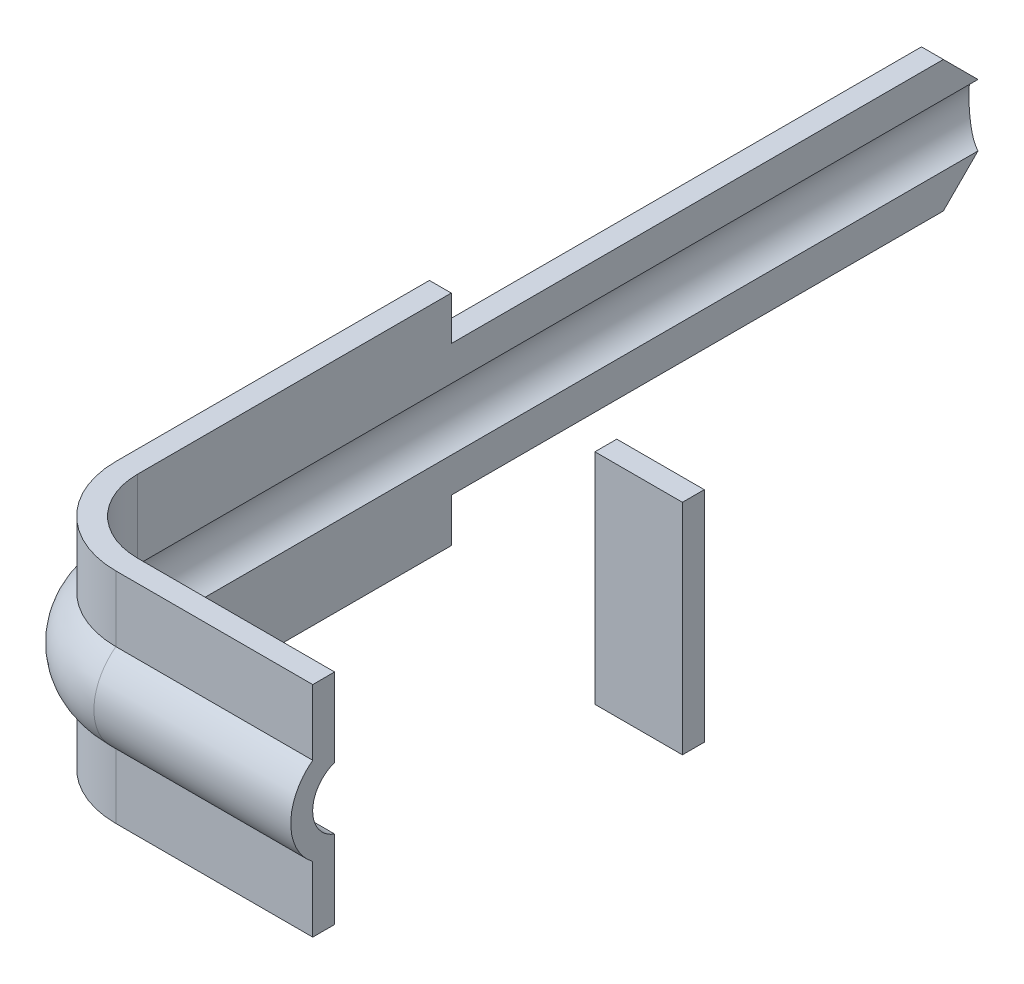
ISO-10303-21;
HEADER;
FILE_DESCRIPTION(('STEP AP214'),'2;1');
FILE_NAME('part.step','',(''),(''),'','','');
FILE_SCHEMA(('AUTOMOTIVE_DESIGN { 1 0 10303 214 1 1 1 1 }'));
ENDSEC;
DATA;
#1=APPLICATION_CONTEXT('core data for automotive mechanical design processes');
#2=APPLICATION_PROTOCOL_DEFINITION('international standard','automotive_design',2000,#1);
#3=PRODUCT_CONTEXT('',#1,'mechanical');
#4=PRODUCT('Part','Part','',(#3));
#5=PRODUCT_RELATED_PRODUCT_CATEGORY('part','',(#4));
#6=PRODUCT_DEFINITION_FORMATION('','',#4);
#7=PRODUCT_DEFINITION_CONTEXT('part definition',#1,'design');
#8=PRODUCT_DEFINITION('design','',#6,#7);
#9=PRODUCT_DEFINITION_SHAPE('','',#8);
#10=(LENGTH_UNIT() NAMED_UNIT(*) SI_UNIT(.MILLI.,.METRE.));
#11=(NAMED_UNIT(*) PLANE_ANGLE_UNIT() SI_UNIT($,.RADIAN.));
#12=(NAMED_UNIT(*) SI_UNIT($,.STERADIAN.) SOLID_ANGLE_UNIT());
#13=UNCERTAINTY_MEASURE_WITH_UNIT(LENGTH_MEASURE(1.E-05),#10,'distance_accuracy_value','');
#14=(GEOMETRIC_REPRESENTATION_CONTEXT(3) GLOBAL_UNCERTAINTY_ASSIGNED_CONTEXT((#13)) GLOBAL_UNIT_ASSIGNED_CONTEXT((#10,
#11,#12)) REPRESENTATION_CONTEXT('',''));
#15=CARTESIAN_POINT('',(0.,0.,0.));
#16=DIRECTION('',(0.,0.,1.));
#17=DIRECTION('',(1.,0.,0.));
#18=AXIS2_PLACEMENT_3D('',#15,#16,#17);
#19=CARTESIAN_POINT('',(1.585000001916,0.750000000914964,4.1242639600522));
#20=DIRECTION('',(0.,0.,-1.));
#21=DIRECTION('',(-1.,0.,0.));
#22=AXIS2_PLACEMENT_3D('',#19,#20,#21);
#23=PLANE('',#22);
#24=DIRECTION('',(0.,1.,0.));
#25=VECTOR('',#24,1.);
#26=CARTESIAN_POINT('',(2.185000001916,0.750000000914964,4.1242639600522));
#27=LINE('',#26,#25);
#28=CARTESIAN_POINT('',(2.185000001916,0.750000000914964,4.1242639600522));
#29=VERTEX_POINT('',#28);
#30=CARTESIAN_POINT('',(2.185000001916,-0.750000000186744,4.1242639600522));
#31=VERTEX_POINT('',#30);
#32=EDGE_CURVE('P0_E54',#29,#31,#27,.F.);
#33=ORIENTED_EDGE('',*,*,#32,.T.);
#34=DIRECTION('',(1.,0.,0.));
#35=VECTOR('',#34,1.);
#36=CARTESIAN_POINT('',(2.185000001916,-0.750000000186744,4.1242639600522));
#37=LINE('',#36,#35);
#38=CARTESIAN_POINT('',(1.585000001916,-0.750000000186744,4.1242639600522));
#39=VERTEX_POINT('',#38);
#40=EDGE_CURVE('P0_E75',#31,#39,#37,.F.);
#41=ORIENTED_EDGE('',*,*,#40,.T.);
#42=DIRECTION('',(0.,1.,0.));
#43=VECTOR('',#42,1.);
#44=CARTESIAN_POINT('',(1.585000001916,-0.750000000186744,4.1242639600522));
#45=LINE('',#44,#43);
#46=CARTESIAN_POINT('',(1.585000001916,0.750000000914964,4.1242639600522));
#47=VERTEX_POINT('',#46);
#48=EDGE_CURVE('P0_E57',#39,#47,#45,.T.);
#49=ORIENTED_EDGE('',*,*,#48,.T.);
#50=DIRECTION('',(1.,0.,0.));
#51=VECTOR('',#50,1.);
#52=CARTESIAN_POINT('',(1.585000001916,0.750000000914964,4.1242639600522));
#53=LINE('',#52,#51);
#54=EDGE_CURVE('P0_E19',#47,#29,#53,.T.);
#55=ORIENTED_EDGE('',*,*,#54,.T.);
#56=EDGE_LOOP('',(#33,#41,#49,#55));
#57=FACE_BOUND('',#56,.T.);
#58=ADVANCED_FACE('P0_F16',(#57),#23,.T.);
#59=CARTESIAN_POINT('',(1.585000001916,0.750000000914964,4.1242639600522));
#60=DIRECTION('',(0.,-1.,0.));
#61=DIRECTION('',(0.,0.,-1.));
#62=AXIS2_PLACEMENT_3D('',#59,#60,#61);
#63=PLANE('',#62);
#64=DIRECTION('',(0.,0.,1.));
#65=VECTOR('',#64,1.);
#66=CARTESIAN_POINT('',(2.185000001916,0.750000000914964,4.1242639600522));
#67=LINE('',#66,#65);
#68=CARTESIAN_POINT('',(2.185000001916,0.750000000914964,4.2742639600522));
#69=VERTEX_POINT('',#68);
#70=EDGE_CURVE('P0_E62',#69,#29,#67,.F.);
#71=ORIENTED_EDGE('',*,*,#70,.T.);
#72=ORIENTED_EDGE('',*,*,#54,.F.);
#73=DIRECTION('',(0.,0.,-1.));
#74=VECTOR('',#73,1.);
#75=CARTESIAN_POINT('',(1.585000001916,0.750000000914964,4.1242639600522));
#76=LINE('',#75,#74);
#77=CARTESIAN_POINT('',(1.585000001916,0.750000000914964,4.2742639600522));
#78=VERTEX_POINT('',#77);
#79=EDGE_CURVE('P0_E79',#47,#78,#76,.F.);
#80=ORIENTED_EDGE('',*,*,#79,.T.);
#81=DIRECTION('',(-1.,0.,0.));
#82=VECTOR('',#81,1.);
#83=CARTESIAN_POINT('',(1.585000001916,0.750000000914964,4.2742639600522));
#84=LINE('',#83,#82);
#85=EDGE_CURVE('P0_E72',#78,#69,#84,.F.);
#86=ORIENTED_EDGE('',*,*,#85,.T.);
#87=EDGE_LOOP('',(#71,#72,#80,#86));
#88=FACE_BOUND('',#87,.T.);
#89=ADVANCED_FACE('P0_F71',(#88),#63,.F.);
#90=CARTESIAN_POINT('',(2.185000001916,0.750000000914964,4.1242639600522));
#91=DIRECTION('',(-1.,0.,0.));
#92=DIRECTION('',(0.,0.,1.));
#93=AXIS2_PLACEMENT_3D('',#90,#91,#92);
#94=PLANE('',#93);
#95=DIRECTION('',(0.,0.,1.));
#96=VECTOR('',#95,1.);
#97=CARTESIAN_POINT('',(2.185000001916,-0.750000000186744,4.1242639600522));
#98=LINE('',#97,#96);
#99=CARTESIAN_POINT('',(2.185000001916,-0.750000000186744,4.2742639600522));
#100=VERTEX_POINT('',#99);
#101=EDGE_CURVE('P0_E68',#100,#31,#98,.F.);
#102=ORIENTED_EDGE('',*,*,#101,.T.);
#103=ORIENTED_EDGE('',*,*,#32,.F.);
#104=ORIENTED_EDGE('',*,*,#70,.F.);
#105=DIRECTION('',(0.,1.,0.));
#106=VECTOR('',#105,1.);
#107=CARTESIAN_POINT('',(2.185000001916,0.750000000914964,4.2742639600522));
#108=LINE('',#107,#106);
#109=EDGE_CURVE('P0_E82',#69,#100,#108,.F.);
#110=ORIENTED_EDGE('',*,*,#109,.T.);
#111=EDGE_LOOP('',(#102,#103,#104,#110));
#112=FACE_BOUND('',#111,.T.);
#113=ADVANCED_FACE('P0_F65',(#112),#94,.F.);
#114=CARTESIAN_POINT('',(2.185000001916,-0.750000000186744,4.1242639600522));
#115=DIRECTION('',(0.,1.,0.));
#116=DIRECTION('',(0.,0.,1.));
#117=AXIS2_PLACEMENT_3D('',#114,#115,#116);
#118=PLANE('',#117);
#119=DIRECTION('',(0.,0.,-1.));
#120=VECTOR('',#119,1.);
#121=CARTESIAN_POINT('',(1.585000001916,-0.750000000186744,4.1242639600522));
#122=LINE('',#121,#120);
#123=CARTESIAN_POINT('',(1.585000001916,-0.750000000186744,4.2742639600522));
#124=VERTEX_POINT('',#123);
#125=EDGE_CURVE('P0_E33',#124,#39,#122,.T.);
#126=ORIENTED_EDGE('',*,*,#125,.T.);
#127=ORIENTED_EDGE('',*,*,#40,.F.);
#128=ORIENTED_EDGE('',*,*,#101,.F.);
#129=DIRECTION('',(-1.,0.,0.));
#130=VECTOR('',#129,1.);
#131=CARTESIAN_POINT('',(1.585000001916,-0.750000000186744,4.2742639600522));
#132=LINE('',#131,#130);
#133=EDGE_CURVE('P0_E25',#100,#124,#132,.T.);
#134=ORIENTED_EDGE('',*,*,#133,.T.);
#135=EDGE_LOOP('',(#126,#127,#128,#134));
#136=FACE_BOUND('',#135,.T.);
#137=ADVANCED_FACE('P0_F87',(#136),#118,.F.);
#138=CARTESIAN_POINT('',(1.585000001916,-0.750000000186744,4.1242639600522));
#139=DIRECTION('',(1.,0.,0.));
#140=DIRECTION('',(0.,0.,-1.));
#141=AXIS2_PLACEMENT_3D('',#138,#139,#140);
#142=PLANE('',#141);
#143=ORIENTED_EDGE('',*,*,#79,.F.);
#144=ORIENTED_EDGE('',*,*,#48,.F.);
#145=ORIENTED_EDGE('',*,*,#125,.F.);
#146=DIRECTION('',(0.,1.,0.));
#147=VECTOR('',#146,1.);
#148=CARTESIAN_POINT('',(1.585000001916,0.750000000914964,4.2742639600522));
#149=LINE('',#148,#147);
#150=EDGE_CURVE('P0_E11',#124,#78,#149,.T.);
#151=ORIENTED_EDGE('',*,*,#150,.T.);
#152=EDGE_LOOP('',(#143,#144,#145,#151));
#153=FACE_BOUND('',#152,.T.);
#154=ADVANCED_FACE('P0_F90',(#153),#142,.F.);
#155=CARTESIAN_POINT('',(1.585000001916,0.750000000914964,4.2742639600522));
#156=DIRECTION('',(0.,0.,-1.));
#157=DIRECTION('',(-1.,0.,0.));
#158=AXIS2_PLACEMENT_3D('',#155,#156,#157);
#159=PLANE('',#158);
#160=ORIENTED_EDGE('',*,*,#133,.F.);
#161=ORIENTED_EDGE('',*,*,#109,.F.);
#162=ORIENTED_EDGE('',*,*,#85,.F.);
#163=ORIENTED_EDGE('',*,*,#150,.F.);
#164=EDGE_LOOP('',(#160,#161,#162,#163));
#165=FACE_BOUND('',#164,.T.);
#166=ADVANCED_FACE('P0_F89',(#165),#159,.F.);
#167=CLOSED_SHELL('',(#58,#89,#113,#137,#154,#166));
#168=MANIFOLD_SOLID_BREP('P0_B1',#167);
#169=CARTESIAN_POINT('',(0.224514864385138,0.,0.));
#170=DIRECTION('',(0.,0.,1.));
#171=DIRECTION('',(1.,0.,0.));
#172=AXIS2_PLACEMENT_3D('',#169,#170,#171);
#173=CYLINDRICAL_SURFACE('',#172,0.225);
#174=DIRECTION('',(0.,0.,-1.));
#175=VECTOR('',#174,1.);
#176=CARTESIAN_POINT('',(0.149999999999984,0.212302932117392,0.));
#177=LINE('',#176,#175);
#178=CARTESIAN_POINT('',(0.149999999999983,0.212302932117392,5.97426396014739));
#179=VERTEX_POINT('',#178);
#180=CARTESIAN_POINT('',(0.149757432221938,0.212217483247041,0.212217483226314));
#181=VERTEX_POINT('',#180);
#182=EDGE_CURVE('P1_E214',#179,#181,#177,.T.);
#183=ORIENTED_EDGE('',*,*,#182,.F.);
#184=CARTESIAN_POINT('',(0.224514864385138,0.,5.97426396014739));
#185=DIRECTION('',(0.,0.,1.));
#186=DIRECTION('',(-1.,0.,0.));
#187=AXIS2_PLACEMENT_3D('',#184,#185,#186);
#188=CIRCLE('',#187,0.225);
#189=CARTESIAN_POINT('',(0.15000000396699,-0.212302933509842,5.97426396014739));
#190=VERTEX_POINT('',#189);
#191=EDGE_CURVE('P1_E536',#179,#190,#188,.T.);
#192=ORIENTED_EDGE('',*,*,#191,.T.);
#193=DIRECTION('',(0.,0.,-1.));
#194=VECTOR('',#193,1.);
#195=CARTESIAN_POINT('',(0.15000000396699,-0.212302933509843,0.));
#196=LINE('',#195,#194);
#197=CARTESIAN_POINT('',(0.149757434146686,-0.212217483922541,0.212217483943265));
#198=VERTEX_POINT('',#197);
#199=EDGE_CURVE('P1_E248',#198,#190,#196,.F.);
#200=ORIENTED_EDGE('',*,*,#199,.F.);
#201=CARTESIAN_POINT('',(0.149757346702161,0.21221754393944,0.212217665156353));
#202=CARTESIAN_POINT('',(0.136913331339535,0.207665311898192,0.207641285261507));
#203=CARTESIAN_POINT('',(0.124743609192929,0.202093573160082,0.202374706611005));
#204=CARTESIAN_POINT('',(0.101764791812559,0.189038470445277,0.191163639415629));
#205=CARTESIAN_POINT('',(0.0909592756904194,0.18155022785134,0.185217442549227));
#206=CARTESIAN_POINT('',(0.0708231016284059,0.164844008717313,0.173401493911863));
#207=CARTESIAN_POINT('',(0.0614873586093797,0.155632248626892,0.167531546053112));
#208=CARTESIAN_POINT('',(0.0444262683993457,0.135522936559536,0.156374193563733));
#209=CARTESIAN_POINT('',(0.0366983669126014,0.124628107126819,0.151085871333887));
#210=CARTESIAN_POINT('',(0.0245245326978146,0.103655504290283,0.142561158713519));
#211=CARTESIAN_POINT('',(0.0197308197484496,0.0938608249430644,0.139126152403672));
#212=CARTESIAN_POINT('',(0.011551086021331,0.0734316039872059,0.133196081029953));
#213=CARTESIAN_POINT('',(0.00816396133167622,0.0627977288224827,0.130700279009129));
#214=CARTESIAN_POINT('',(0.00296983712234125,0.0408707701312072,0.126851678206735));
#215=CARTESIAN_POINT('',(0.00117302238926358,0.0295739247620855,0.125506248564731));
#216=CARTESIAN_POINT('',(-0.000674152154730775,0.00675883042992519,0.124122956573618));
#217=CARTESIAN_POINT('',(-0.000725196683673462,-0.00475932995634256,0.124084581577523));
#218=CARTESIAN_POINT('',(0.000833666883458502,-0.0264026469089063,0.125252200857111));
#219=CARTESIAN_POINT('',(0.00227132925443989,-0.0365480597377179,0.126329151778766));
#220=CARTESIAN_POINT('',(0.00646367665865537,-0.0564065368881361,0.129443181820884));
#221=CARTESIAN_POINT('',(0.00921845957677584,-0.066119569017708,0.131480332300658));
#222=CARTESIAN_POINT('',(0.0160140530283502,-0.0851947367255245,0.136441161024372));
#223=CARTESIAN_POINT('',(0.0200917183415792,-0.0945369707055503,0.139390115283347));
#224=CARTESIAN_POINT('',(0.0293447755621372,-0.112405646504791,0.145955322285442));
#225=CARTESIAN_POINT('',(0.0345208304332887,-0.120931591099158,0.149571977866256));
#226=CARTESIAN_POINT('',(0.0467655263477221,-0.138428197465193,0.157906567622749));
#227=CARTESIAN_POINT('',(0.0540056176606778,-0.147238922958504,0.16270770193375));
#228=CARTESIAN_POINT('',(0.0696222494078104,-0.163588406049553,0.172608615901019));
#229=CARTESIAN_POINT('',(0.0779992964986616,-0.171126593191963,0.177708528121245));
#230=CARTESIAN_POINT('',(0.0962391997336202,-0.185230153836376,0.18810855100274));
#231=CARTESIAN_POINT('',(0.106154613379122,-0.191730103686799,0.193406286455824));
#232=CARTESIAN_POINT('',(0.127115306318748,-0.203172042032617,0.203400371109372));
#233=CARTESIAN_POINT('',(0.138160612314672,-0.208113993697874,0.208096706091531));
#234=CARTESIAN_POINT('',(0.149757322899515,-0.212217600568487,0.212217635117401));
#235=B_SPLINE_CURVE_WITH_KNOTS('',3,(#201,#202,#203,#204,#205,#206,#207,#208,#209,#210,#211,
#212,#213,#214,#215,#216,#217,#218,#219,#220,#221,#222,#223,#224,#225,#226,#227,#228,#229,#230,
#231,#232,#233,#234),.UNSPECIFIED.,.F.,.F.,(4,2,2,2,2,2,2,2,2,2,2,2,2,2,2,2,4),(0.,
0.0429747666319987,0.0860600364104163,0.128992799998506,0.171856828737294,0.206019561810953,
0.240155432548395,0.274508369205703,0.308847831956318,0.339614768140892,0.370383991197601,
0.402097005387604,0.433829215578944,0.470813229583805,0.5078137790613,0.546619925154412,
0.585426988532671),.UNSPECIFIED.);
#236=EDGE_CURVE('P1_E174',#181,#198,#235,.T.);
#237=ORIENTED_EDGE('',*,*,#236,.F.);
#238=EDGE_LOOP('',(#183,#192,#200,#237));
#239=FACE_BOUND('',#238,.T.);
#240=ADVANCED_FACE('P1_F16',(#239),#173,.F.);
#241=CARTESIAN_POINT('',(0.65,0.,6.39974909576226));
#242=DIRECTION('',(1.,0.,0.));
#243=DIRECTION('',(0.,0.,-1.));
#244=AXIS2_PLACEMENT_3D('',#241,#242,#243);
#245=CYLINDRICAL_SURFACE('',#244,0.375);
#246=DIRECTION('',(1.,0.,0.));
#247=VECTOR('',#246,1.);
#248=CARTESIAN_POINT('',(0.65,0.300363239545214,6.62426396014739));
#249=LINE('',#248,#247);
#250=CARTESIAN_POINT('',(0.65,0.300363239545214,6.62426396014739));
#251=VERTEX_POINT('',#250);
#252=CARTESIAN_POINT('',(2.,0.300363239545216,6.62426396014739));
#253=VERTEX_POINT('',#252);
#254=EDGE_CURVE('P1_E168',#251,#253,#249,.T.);
#255=ORIENTED_EDGE('',*,*,#254,.F.);
#256=CARTESIAN_POINT('',(0.65,0.,6.39974909576226));
#257=DIRECTION('',(1.,0.,0.));
#258=DIRECTION('',(0.,0.,-1.));
#259=AXIS2_PLACEMENT_3D('',#256,#257,#258);
#260=CIRCLE('',#259,0.375);
#261=CARTESIAN_POINT('',(0.65,-0.300363239545311,6.62426396014739));
#262=VERTEX_POINT('',#261);
#263=EDGE_CURVE('P1_E173',#251,#262,#260,.T.);
#264=ORIENTED_EDGE('',*,*,#263,.T.);
#265=DIRECTION('',(1.,0.,0.));
#266=VECTOR('',#265,1.);
#267=CARTESIAN_POINT('',(0.65,-0.30036323954531,6.62426396014739));
#268=LINE('',#267,#266);
#269=CARTESIAN_POINT('',(2.,-0.300363239545312,6.62426396014739));
#270=VERTEX_POINT('',#269);
#271=EDGE_CURVE('P1_E171',#270,#262,#268,.F.);
#272=ORIENTED_EDGE('',*,*,#271,.F.);
#273=CARTESIAN_POINT('',(2.,0.,6.39974909576226));
#274=DIRECTION('',(1.,0.,0.));
#275=DIRECTION('',(0.,0.,-1.));
#276=AXIS2_PLACEMENT_3D('',#273,#274,#275);
#277=CIRCLE('',#276,0.375);
#278=EDGE_CURVE('P1_E162',#270,#253,#277,.F.);
#279=ORIENTED_EDGE('',*,*,#278,.T.);
#280=EDGE_LOOP('',(#255,#264,#272,#279));
#281=FACE_BOUND('',#280,.T.);
#282=ADVANCED_FACE('P1_F167',(#281),#245,.T.);
#283=CARTESIAN_POINT('',(0.65,0.,6.39974909576226));
#284=DIRECTION('',(1.,0.,0.));
#285=DIRECTION('',(0.,0.,-1.));
#286=AXIS2_PLACEMENT_3D('',#283,#284,#285);
#287=CYLINDRICAL_SURFACE('',#286,0.225);
#288=CARTESIAN_POINT('',(2.,0.,6.39974909576226));
#289=DIRECTION('',(1.,0.,0.));
#290=DIRECTION('',(0.,0.,-1.));
#291=AXIS2_PLACEMENT_3D('',#288,#289,#290);
#292=CIRCLE('',#291,0.225);
#293=CARTESIAN_POINT('',(2.,0.212302932117393,6.47426396014741));
#294=VERTEX_POINT('',#293);
#295=CARTESIAN_POINT('',(2.,-0.212302933509843,6.4742639561804));
#296=VERTEX_POINT('',#295);
#297=EDGE_CURVE('P1_E189',#294,#296,#292,.T.);
#298=ORIENTED_EDGE('',*,*,#297,.T.);
#299=DIRECTION('',(-1.,0.,0.));
#300=VECTOR('',#299,1.);
#301=CARTESIAN_POINT('',(0.65,-0.212302933509842,6.4742639561804));
#302=LINE('',#301,#300);
#303=CARTESIAN_POINT('',(0.65,-0.212302933509842,6.4742639561804));
#304=VERTEX_POINT('',#303);
#305=EDGE_CURVE('P1_E231',#304,#296,#302,.F.);
#306=ORIENTED_EDGE('',*,*,#305,.F.);
#307=CARTESIAN_POINT('',(0.65,0.,6.39974909576225));
#308=DIRECTION('',(1.,0.,0.));
#309=DIRECTION('',(0.,0.,1.));
#310=AXIS2_PLACEMENT_3D('',#307,#308,#309);
#311=CIRCLE('',#310,0.225);
#312=CARTESIAN_POINT('',(0.65,0.212302932117392,6.47426396014741));
#313=VERTEX_POINT('',#312);
#314=EDGE_CURVE('P1_E249',#304,#313,#311,.F.);
#315=ORIENTED_EDGE('',*,*,#314,.T.);
#316=DIRECTION('',(-1.,0.,0.));
#317=VECTOR('',#316,1.);
#318=CARTESIAN_POINT('',(0.65,0.212302932117392,6.47426396014741));
#319=LINE('',#318,#317);
#320=EDGE_CURVE('P1_E252',#294,#313,#319,.T.);
#321=ORIENTED_EDGE('',*,*,#320,.F.);
#322=EDGE_LOOP('',(#298,#306,#315,#321));
#323=FACE_BOUND('',#322,.T.);
#324=ADVANCED_FACE('P1_F273',(#323),#287,.F.);
#325=CARTESIAN_POINT('',(0.65,0.,5.97426396014739));
#326=DIRECTION('',(0.,1.,0.));
#327=DIRECTION('',(0.,0.,1.));
#328=AXIS2_PLACEMENT_3D('',#325,#326,#327);
#329=TOROIDAL_SURFACE('',#328,0.425485135614863,0.225);
#330=ORIENTED_EDGE('',*,*,#314,.F.);
#331=CARTESIAN_POINT('',(0.65,-0.212302933509842,5.97426396014739));
#332=DIRECTION('',(0.,1.,0.));
#333=DIRECTION('',(0.,0.,1.));
#334=AXIS2_PLACEMENT_3D('',#331,#332,#333);
#335=CIRCLE('',#334,0.49999999603301);
#336=EDGE_CURVE('P1_E236',#304,#190,#335,.F.);
#337=ORIENTED_EDGE('',*,*,#336,.T.);
#338=ORIENTED_EDGE('',*,*,#191,.F.);
#339=CARTESIAN_POINT('',(0.65,0.212302932117392,5.97426396014739));
#340=DIRECTION('',(0.,1.,0.));
#341=DIRECTION('',(0.,0.,1.));
#342=AXIS2_PLACEMENT_3D('',#339,#340,#341);
#343=CIRCLE('',#342,0.500000000000017);
#344=EDGE_CURVE('P1_E258',#179,#313,#343,.T.);
#345=ORIENTED_EDGE('',*,*,#344,.T.);
#346=EDGE_LOOP('',(#330,#337,#338,#345));
#347=FACE_BOUND('',#346,.T.);
#348=ADVANCED_FACE('P1_F268',(#347),#329,.F.);
#349=CARTESIAN_POINT('',(0.15000000396699,-0.75,0.));
#350=DIRECTION('',(1.,0.,0.));
#351=DIRECTION('',(0.,0.,-1.));
#352=AXIS2_PLACEMENT_3D('',#349,#350,#351);
#353=PLANE('',#352);
#354=DIRECTION('',(0.,0.,-1.));
#355=VECTOR('',#354,1.);
#356=CARTESIAN_POINT('',(0.150000003738779,-0.75,0.));
#357=LINE('',#356,#355);
#358=CARTESIAN_POINT('',(0.150000003738779,-0.75,3.82426435382759));
#359=VERTEX_POINT('',#358);
#360=CARTESIAN_POINT('',(0.150000003852885,-0.75,5.97426396014739));
#361=VERTEX_POINT('',#360);
#362=EDGE_CURVE('P1_E393',#359,#361,#357,.F.);
#363=ORIENTED_EDGE('',*,*,#362,.F.);
#364=DIRECTION('',(0.,1.,0.));
#365=VECTOR('',#364,1.);
#366=CARTESIAN_POINT('',(0.150000003738779,-0.449999999979276,3.82426435382759));
#367=LINE('',#366,#365);
#368=CARTESIAN_POINT('',(0.150000003776814,-0.449999999979276,3.82426435382759));
#369=VERTEX_POINT('',#368);
#370=EDGE_CURVE('P1_E239',#369,#359,#367,.F.);
#371=ORIENTED_EDGE('',*,*,#370,.F.);
#372=DIRECTION('',(0.,0.,-1.));
#373=VECTOR('',#372,1.);
#374=CARTESIAN_POINT('',(0.150000003852885,-0.449999999979276,0.));
#375=LINE('',#374,#373);
#376=CARTESIAN_POINT('',(0.15000000389092,-0.449999999979276,0.45));
#377=VERTEX_POINT('',#376);
#378=EDGE_CURVE('P1_E419',#377,#369,#375,.F.);
#379=ORIENTED_EDGE('',*,*,#378,.F.);
#380=DIRECTION('',(0.,0.707106781186547,-0.707106781186548));
#381=VECTOR('',#380,1.);
#382=CARTESIAN_POINT('',(0.15000000396699,-0.449999999979276,0.45));
#383=LINE('',#382,#381);
#384=EDGE_CURVE('P1_E245',#377,#198,#383,.T.);
#385=ORIENTED_EDGE('',*,*,#384,.T.);
#386=ORIENTED_EDGE('',*,*,#199,.T.);
#387=DIRECTION('',(0.,1.,0.));
#388=VECTOR('',#387,1.);
#389=CARTESIAN_POINT('',(0.15000000396699,0.,5.97426396014739));
#390=LINE('',#389,#388);
#391=EDGE_CURVE('P1_E232',#190,#361,#390,.F.);
#392=ORIENTED_EDGE('',*,*,#391,.T.);
#393=EDGE_LOOP('',(#363,#371,#379,#385,#386,#392));
#394=FACE_BOUND('',#393,.T.);
#395=ADVANCED_FACE('P1_F272',(#394),#353,.T.);
#396=CARTESIAN_POINT('',(0.65,0.,5.97426396014739));
#397=DIRECTION('',(0.,1.,0.));
#398=DIRECTION('',(0.,0.,1.));
#399=AXIS2_PLACEMENT_3D('',#396,#397,#398);
#400=CYLINDRICAL_SURFACE('',#399,0.49999999603301);
#401=CARTESIAN_POINT('',(0.65,-0.75,5.97426396014739));
#402=DIRECTION('',(0.,1.,0.));
#403=DIRECTION('',(0.,0.,1.));
#404=AXIS2_PLACEMENT_3D('',#401,#402,#403);
#405=CIRCLE('',#404,0.49999999603301);
#406=CARTESIAN_POINT('',(0.65,-0.75,6.4742639561804));
#407=VERTEX_POINT('',#406);
#408=EDGE_CURVE('P1_E388',#361,#407,#405,.T.);
#409=ORIENTED_EDGE('',*,*,#408,.F.);
#410=ORIENTED_EDGE('',*,*,#391,.F.);
#411=ORIENTED_EDGE('',*,*,#336,.F.);
#412=DIRECTION('',(0.,1.,0.));
#413=VECTOR('',#412,1.);
#414=CARTESIAN_POINT('',(0.65,-0.75,6.4742639561804));
#415=LINE('',#414,#413);
#416=EDGE_CURVE('P1_E228',#407,#304,#415,.T.);
#417=ORIENTED_EDGE('',*,*,#416,.F.);
#418=EDGE_LOOP('',(#409,#410,#411,#417));
#419=FACE_BOUND('',#418,.T.);
#420=ADVANCED_FACE('P1_F377',(#419),#400,.F.);
#421=CARTESIAN_POINT('',(0.65,-0.75,6.4742639561804));
#422=DIRECTION('',(0.,0.,-1.));
#423=DIRECTION('',(-1.,0.,0.));
#424=AXIS2_PLACEMENT_3D('',#421,#422,#423);
#425=PLANE('',#424);
#426=ORIENTED_EDGE('',*,*,#416,.T.);
#427=ORIENTED_EDGE('',*,*,#305,.T.);
#428=DIRECTION('',(0.,1.,0.));
#429=VECTOR('',#428,1.);
#430=CARTESIAN_POINT('',(2.,0.,6.4742639561804));
#431=LINE('',#430,#429);
#432=CARTESIAN_POINT('',(2.,-0.75,6.4742639561804));
#433=VERTEX_POINT('',#432);
#434=EDGE_CURVE('P1_E182',#296,#433,#431,.F.);
#435=ORIENTED_EDGE('',*,*,#434,.T.);
#436=DIRECTION('',(1.,0.,0.));
#437=VECTOR('',#436,1.);
#438=CARTESIAN_POINT('',(0.,-0.75,6.4742639561804));
#439=LINE('',#438,#437);
#440=EDGE_CURVE('P1_E225',#407,#433,#439,.T.);
#441=ORIENTED_EDGE('',*,*,#440,.F.);
#442=EDGE_LOOP('',(#426,#427,#435,#441));
#443=FACE_BOUND('',#442,.T.);
#444=ADVANCED_FACE('P1_F374',(#443),#425,.T.);
#445=CARTESIAN_POINT('',(0.65,-0.30036323954531,6.62426396014739));
#446=DIRECTION('',(0.,0.,1.));
#447=DIRECTION('',(1.,0.,0.));
#448=AXIS2_PLACEMENT_3D('',#445,#446,#447);
#449=PLANE('',#448);
#450=ORIENTED_EDGE('',*,*,#271,.T.);
#451=DIRECTION('',(0.,1.,0.));
#452=VECTOR('',#451,1.);
#453=CARTESIAN_POINT('',(0.65,-0.30036323954531,6.62426396014739));
#454=LINE('',#453,#452);
#455=CARTESIAN_POINT('',(0.65,-0.75,6.62426396014739));
#456=VERTEX_POINT('',#455);
#457=EDGE_CURVE('P1_E217',#262,#456,#454,.F.);
#458=ORIENTED_EDGE('',*,*,#457,.T.);
#459=DIRECTION('',(1.,0.,0.));
#460=VECTOR('',#459,1.);
#461=CARTESIAN_POINT('',(0.,-0.75,6.62426396014739));
#462=LINE('',#461,#460);
#463=CARTESIAN_POINT('',(2.,-0.75,6.62426396014739));
#464=VERTEX_POINT('',#463);
#465=EDGE_CURVE('P1_E224',#464,#456,#462,.F.);
#466=ORIENTED_EDGE('',*,*,#465,.F.);
#467=DIRECTION('',(0.,1.,0.));
#468=VECTOR('',#467,1.);
#469=CARTESIAN_POINT('',(2.,0.,6.62426396014739));
#470=LINE('',#469,#468);
#471=EDGE_CURVE('P1_E190',#464,#270,#470,.T.);
#472=ORIENTED_EDGE('',*,*,#471,.T.);
#473=EDGE_LOOP('',(#450,#458,#466,#472));
#474=FACE_BOUND('',#473,.T.);
#475=ADVANCED_FACE('P1_F370',(#474),#449,.T.);
#476=CARTESIAN_POINT('',(0.149999999999984,0.212302932117392,0.));
#477=DIRECTION('',(1.,0.,0.));
#478=DIRECTION('',(0.,0.,-1.));
#479=AXIS2_PLACEMENT_3D('',#476,#477,#478);
#480=PLANE('',#479);
#481=DIRECTION('',(0.,0.,1.));
#482=VECTOR('',#481,1.);
#483=CARTESIAN_POINT('',(0.149999999999983,0.75,0.));
#484=LINE('',#483,#482);
#485=CARTESIAN_POINT('',(0.149999999999983,0.75,5.97426396014739));
#486=VERTEX_POINT('',#485);
#487=CARTESIAN_POINT('',(0.149999999923994,0.75,3.82426435382759));
#488=VERTEX_POINT('',#487);
#489=EDGE_CURVE('P1_E461',#486,#488,#484,.F.);
#490=ORIENTED_EDGE('',*,*,#489,.F.);
#491=DIRECTION('',(0.,1.,0.));
#492=VECTOR('',#491,1.);
#493=CARTESIAN_POINT('',(0.149999999999983,0.,5.97426396014739));
#494=LINE('',#493,#492);
#495=EDGE_CURVE('P1_E255',#486,#179,#494,.F.);
#496=ORIENTED_EDGE('',*,*,#495,.T.);
#497=ORIENTED_EDGE('',*,*,#182,.T.);
#498=DIRECTION('',(0.,0.707106781186546,0.707106781186549));
#499=VECTOR('',#498,1.);
#500=CARTESIAN_POINT('',(0.149999999999984,0.212302932117392,0.212302932096665));
#501=LINE('',#500,#499);
#502=CARTESIAN_POINT('',(0.149999999923994,0.450000000020726,0.45));
#503=VERTEX_POINT('',#502);
#504=EDGE_CURVE('P1_E208',#181,#503,#501,.T.);
#505=ORIENTED_EDGE('',*,*,#504,.T.);
#506=DIRECTION('',(0.,0.,1.));
#507=VECTOR('',#506,1.);
#508=CARTESIAN_POINT('',(0.149999999772015,0.450000000020726,3.82426435382759));
#509=LINE('',#508,#507);
#510=CARTESIAN_POINT('',(0.149999999848004,0.450000000020726,3.82426435382759));
#511=VERTEX_POINT('',#510);
#512=EDGE_CURVE('P1_E437',#511,#503,#509,.F.);
#513=ORIENTED_EDGE('',*,*,#512,.F.);
#514=DIRECTION('',(0.,1.,0.));
#515=VECTOR('',#514,1.);
#516=CARTESIAN_POINT('',(0.149999999999983,0.212302932117392,3.82426435382759));
#517=LINE('',#516,#515);
#518=EDGE_CURVE('P1_E183',#511,#488,#517,.T.);
#519=ORIENTED_EDGE('',*,*,#518,.T.);
#520=EDGE_LOOP('',(#490,#496,#497,#505,#513,#519));
#521=FACE_BOUND('',#520,.T.);
#522=ADVANCED_FACE('P1_F367',(#521),#480,.T.);
#523=CARTESIAN_POINT('',(0.65,0.75,6.62426396014739));
#524=DIRECTION('',(0.,0.,1.));
#525=DIRECTION('',(1.,0.,0.));
#526=AXIS2_PLACEMENT_3D('',#523,#524,#525);
#527=PLANE('',#526);
#528=DIRECTION('',(1.,0.,0.));
#529=VECTOR('',#528,1.);
#530=CARTESIAN_POINT('',(0.149999999999984,0.75,6.62426396014739));
#531=LINE('',#530,#529);
#532=CARTESIAN_POINT('',(0.65,0.75,6.62426396014739));
#533=VERTEX_POINT('',#532);
#534=CARTESIAN_POINT('',(2.,0.75,6.62426396014739));
#535=VERTEX_POINT('',#534);
#536=EDGE_CURVE('P1_E454',#533,#535,#531,.T.);
#537=ORIENTED_EDGE('',*,*,#536,.F.);
#538=DIRECTION('',(0.,1.,0.));
#539=VECTOR('',#538,1.);
#540=CARTESIAN_POINT('',(0.65,0.,6.62426396014739));
#541=LINE('',#540,#539);
#542=EDGE_CURVE('P1_E181',#251,#533,#541,.T.);
#543=ORIENTED_EDGE('',*,*,#542,.F.);
#544=ORIENTED_EDGE('',*,*,#254,.T.);
#545=DIRECTION('',(0.,1.,0.));
#546=VECTOR('',#545,1.);
#547=CARTESIAN_POINT('',(2.,0.,6.62426396014739));
#548=LINE('',#547,#546);
#549=EDGE_CURVE('P1_E179',#253,#535,#548,.T.);
#550=ORIENTED_EDGE('',*,*,#549,.T.);
#551=EDGE_LOOP('',(#537,#543,#544,#550));
#552=FACE_BOUND('',#551,.T.);
#553=ADVANCED_FACE('P1_F178',(#552),#527,.T.);
#554=CARTESIAN_POINT('',(2.,0.,6.39974909576226));
#555=DIRECTION('',(-1.,0.,0.));
#556=DIRECTION('',(0.,0.,1.));
#557=AXIS2_PLACEMENT_3D('',#554,#555,#556);
#558=PLANE('',#557);
#559=DIRECTION('',(0.,1.,0.));
#560=VECTOR('',#559,1.);
#561=CARTESIAN_POINT('',(2.,0.212302932117392,6.47426396014741));
#562=LINE('',#561,#560);
#563=CARTESIAN_POINT('',(2.,0.75,6.47426396014741));
#564=VERTEX_POINT('',#563);
#565=EDGE_CURVE('P1_E193',#564,#294,#562,.F.);
#566=ORIENTED_EDGE('',*,*,#565,.F.);
#567=DIRECTION('',(0.,0.,1.));
#568=VECTOR('',#567,1.);
#569=CARTESIAN_POINT('',(2.,0.75,0.));
#570=LINE('',#569,#568);
#571=EDGE_CURVE('P1_E187',#535,#564,#570,.F.);
#572=ORIENTED_EDGE('',*,*,#571,.F.);
#573=ORIENTED_EDGE('',*,*,#549,.F.);
#574=ORIENTED_EDGE('',*,*,#278,.F.);
#575=ORIENTED_EDGE('',*,*,#471,.F.);
#576=DIRECTION('',(0.,0.,-1.));
#577=VECTOR('',#576,1.);
#578=CARTESIAN_POINT('',(2.,-0.75,0.));
#579=LINE('',#578,#577);
#580=EDGE_CURVE('P1_E221',#433,#464,#579,.F.);
#581=ORIENTED_EDGE('',*,*,#580,.F.);
#582=ORIENTED_EDGE('',*,*,#434,.F.);
#583=ORIENTED_EDGE('',*,*,#297,.F.);
#584=EDGE_LOOP('',(#566,#572,#573,#574,#575,#581,#582,#583));
#585=FACE_BOUND('',#584,.T.);
#586=ADVANCED_FACE('P1_F185',(#585),#558,.F.);
#587=CARTESIAN_POINT('',(0.65,0.212302932117392,6.47426396014741));
#588=DIRECTION('',(0.,0.,-1.));
#589=DIRECTION('',(-1.,0.,0.));
#590=AXIS2_PLACEMENT_3D('',#587,#588,#589);
#591=PLANE('',#590);
#592=ORIENTED_EDGE('',*,*,#320,.T.);
#593=DIRECTION('',(0.,1.,0.));
#594=VECTOR('',#593,1.);
#595=CARTESIAN_POINT('',(0.65,0.,6.47426396014741));
#596=LINE('',#595,#594);
#597=CARTESIAN_POINT('',(0.65,0.75,6.47426396014741));
#598=VERTEX_POINT('',#597);
#599=EDGE_CURVE('P1_E261',#313,#598,#596,.T.);
#600=ORIENTED_EDGE('',*,*,#599,.T.);
#601=DIRECTION('',(1.,0.,0.));
#602=VECTOR('',#601,1.);
#603=CARTESIAN_POINT('',(0.149999999999984,0.75,6.47426396014741));
#604=LINE('',#603,#602);
#605=EDGE_CURVE('P1_E453',#564,#598,#604,.F.);
#606=ORIENTED_EDGE('',*,*,#605,.F.);
#607=ORIENTED_EDGE('',*,*,#565,.T.);
#608=EDGE_LOOP('',(#592,#600,#606,#607));
#609=FACE_BOUND('',#608,.T.);
#610=ADVANCED_FACE('P1_F358',(#609),#591,.T.);
#611=CARTESIAN_POINT('',(0.65,0.,5.97426396014739));
#612=DIRECTION('',(0.,1.,0.));
#613=DIRECTION('',(0.,0.,1.));
#614=AXIS2_PLACEMENT_3D('',#611,#612,#613);
#615=CYLINDRICAL_SURFACE('',#614,0.500000000000017);
#616=ORIENTED_EDGE('',*,*,#599,.F.);
#617=ORIENTED_EDGE('',*,*,#344,.F.);
#618=ORIENTED_EDGE('',*,*,#495,.F.);
#619=CARTESIAN_POINT('',(0.65,0.75,5.97426396014739));
#620=DIRECTION('',(0.,1.,0.));
#621=DIRECTION('',(0.,0.,1.));
#622=AXIS2_PLACEMENT_3D('',#619,#620,#621);
#623=CIRCLE('',#622,0.500000000000017);
#624=EDGE_CURVE('P1_E456',#598,#486,#623,.F.);
#625=ORIENTED_EDGE('',*,*,#624,.F.);
#626=EDGE_LOOP('',(#616,#617,#618,#625));
#627=FACE_BOUND('',#626,.T.);
#628=ADVANCED_FACE('P1_F354',(#627),#615,.F.);
#629=CARTESIAN_POINT('',(0.150000003738779,-0.449999999979276,0.));
#630=DIRECTION('',(0.,-1.,0.));
#631=DIRECTION('',(0.,0.,-1.));
#632=AXIS2_PLACEMENT_3D('',#629,#630,#631);
#633=PLANE('',#632);
#634=ORIENTED_EDGE('',*,*,#378,.T.);
#635=DIRECTION('',(-1.,0.,0.));
#636=VECTOR('',#635,1.);
#637=CARTESIAN_POINT('',(0.150000003738779,-0.449999999979276,3.82426435382759));
#638=LINE('',#637,#636);
#639=CARTESIAN_POINT('',(0.,-0.449999999979276,3.82426435382759));
#640=VERTEX_POINT('',#639);
#641=EDGE_CURVE('P1_E242',#640,#369,#638,.F.);
#642=ORIENTED_EDGE('',*,*,#641,.F.);
#643=DIRECTION('',(0.,0.,1.));
#644=VECTOR('',#643,1.);
#645=CARTESIAN_POINT('',(0.,-0.449999999979276,0.));
#646=LINE('',#645,#644);
#647=CARTESIAN_POINT('',(0.,-0.449999999979276,0.45));
#648=VERTEX_POINT('',#647);
#649=EDGE_CURVE('P1_E414',#648,#640,#646,.T.);
#650=ORIENTED_EDGE('',*,*,#649,.F.);
#651=DIRECTION('',(1.,0.,0.));
#652=VECTOR('',#651,1.);
#653=CARTESIAN_POINT('',(0.224514864385138,-0.449999999979276,0.45));
#654=LINE('',#653,#652);
#655=EDGE_CURVE('P1_E427',#648,#377,#654,.T.);
#656=ORIENTED_EDGE('',*,*,#655,.T.);
#657=EDGE_LOOP('',(#634,#642,#650,#656));
#658=FACE_BOUND('',#657,.T.);
#659=ADVANCED_FACE('P1_F350',(#658),#633,.T.);
#660=CARTESIAN_POINT('',(0.150000003738779,-0.449999999979276,3.82426435382759));
#661=DIRECTION('',(0.,0.,-1.));
#662=DIRECTION('',(-1.,0.,0.));
#663=AXIS2_PLACEMENT_3D('',#660,#661,#662);
#664=PLANE('',#663);
#665=ORIENTED_EDGE('',*,*,#370,.T.);
#666=DIRECTION('',(1.,0.,0.));
#667=VECTOR('',#666,1.);
#668=CARTESIAN_POINT('',(0.,-0.75,3.82426435382759));
#669=LINE('',#668,#667);
#670=CARTESIAN_POINT('',(0.,-0.75,3.82426435382759));
#671=VERTEX_POINT('',#670);
#672=EDGE_CURVE('P1_E241',#671,#359,#669,.T.);
#673=ORIENTED_EDGE('',*,*,#672,.F.);
#674=DIRECTION('',(0.,1.,0.));
#675=VECTOR('',#674,1.);
#676=CARTESIAN_POINT('',(0.,-0.300363239545311,3.82426435382759));
#677=LINE('',#676,#675);
#678=EDGE_CURVE('P1_E410',#640,#671,#677,.F.);
#679=ORIENTED_EDGE('',*,*,#678,.F.);
#680=ORIENTED_EDGE('',*,*,#641,.T.);
#681=EDGE_LOOP('',(#665,#673,#679,#680));
#682=FACE_BOUND('',#681,.T.);
#683=ADVANCED_FACE('P1_F346',(#682),#664,.T.);
#684=CARTESIAN_POINT('',(0.,-0.75,0.));
#685=DIRECTION('',(0.,-1.,0.));
#686=DIRECTION('',(0.,0.,-1.));
#687=AXIS2_PLACEMENT_3D('',#684,#685,#686);
#688=PLANE('',#687);
#689=ORIENTED_EDGE('',*,*,#465,.T.);
#690=CARTESIAN_POINT('',(0.65,-0.75,5.97426396014739));
#691=DIRECTION('',(0.,1.,0.));
#692=DIRECTION('',(0.,0.,1.));
#693=AXIS2_PLACEMENT_3D('',#690,#691,#692);
#694=CIRCLE('',#693,0.65);
#695=CARTESIAN_POINT('',(0.,-0.75,5.97426396014739));
#696=VERTEX_POINT('',#695);
#697=EDGE_CURVE('P1_E440',#696,#456,#694,.T.);
#698=ORIENTED_EDGE('',*,*,#697,.F.);
#699=DIRECTION('',(0.,0.,1.));
#700=VECTOR('',#699,1.);
#701=CARTESIAN_POINT('',(0.,-0.75,0.));
#702=LINE('',#701,#700);
#703=EDGE_CURVE('P1_E413',#671,#696,#702,.T.);
#704=ORIENTED_EDGE('',*,*,#703,.F.);
#705=ORIENTED_EDGE('',*,*,#672,.T.);
#706=ORIENTED_EDGE('',*,*,#362,.T.);
#707=ORIENTED_EDGE('',*,*,#408,.T.);
#708=ORIENTED_EDGE('',*,*,#440,.T.);
#709=ORIENTED_EDGE('',*,*,#580,.T.);
#710=EDGE_LOOP('',(#689,#698,#704,#705,#706,#707,#708,#709));
#711=FACE_BOUND('',#710,.T.);
#712=ADVANCED_FACE('P1_F342',(#711),#688,.T.);
#713=CARTESIAN_POINT('',(0.65,0.,5.97426396014739));
#714=DIRECTION('',(0.,1.,0.));
#715=DIRECTION('',(0.,0.,1.));
#716=AXIS2_PLACEMENT_3D('',#713,#714,#715);
#717=CYLINDRICAL_SURFACE('',#716,0.65);
#718=CARTESIAN_POINT('',(0.65,-0.30036323954531,5.97426396014739));
#719=DIRECTION('',(0.,1.,0.));
#720=DIRECTION('',(0.,0.,1.));
#721=AXIS2_PLACEMENT_3D('',#718,#719,#720);
#722=CIRCLE('',#721,0.649999999999998);
#723=CARTESIAN_POINT('',(0.,-0.30036323954531,5.97426396014739));
#724=VERTEX_POINT('',#723);
#725=EDGE_CURVE('P1_E742',#724,#262,#722,.T.);
#726=ORIENTED_EDGE('',*,*,#725,.F.);
#727=DIRECTION('',(0.,1.,0.));
#728=VECTOR('',#727,1.);
#729=CARTESIAN_POINT('',(0.,-0.300363239545311,5.97426396014739));
#730=LINE('',#729,#728);
#731=EDGE_CURVE('P1_E508',#696,#724,#730,.T.);
#732=ORIENTED_EDGE('',*,*,#731,.F.);
#733=ORIENTED_EDGE('',*,*,#697,.T.);
#734=ORIENTED_EDGE('',*,*,#457,.F.);
#735=EDGE_LOOP('',(#726,#732,#733,#734));
#736=FACE_BOUND('',#735,.T.);
#737=ADVANCED_FACE('P1_F338',(#736),#717,.T.);
#738=CARTESIAN_POINT('',(0.149999999772015,0.450000000020726,3.82426435382759));
#739=DIRECTION('',(0.,1.,0.));
#740=DIRECTION('',(0.,0.,1.));
#741=AXIS2_PLACEMENT_3D('',#738,#739,#740);
#742=PLANE('',#741);
#743=DIRECTION('',(0.,0.,1.));
#744=VECTOR('',#743,1.);
#745=CARTESIAN_POINT('',(0.,0.450000000020726,0.));
#746=LINE('',#745,#744);
#747=CARTESIAN_POINT('',(0.,0.450000000020726,3.82426435382759));
#748=VERTEX_POINT('',#747);
#749=CARTESIAN_POINT('',(0.,0.450000000020726,0.45));
#750=VERTEX_POINT('',#749);
#751=EDGE_CURVE('P1_E492',#748,#750,#746,.F.);
#752=ORIENTED_EDGE('',*,*,#751,.F.);
#753=DIRECTION('',(-1.,0.,0.));
#754=VECTOR('',#753,1.);
#755=CARTESIAN_POINT('',(0.149999999772015,0.450000000020726,3.82426435382759));
#756=LINE('',#755,#754);
#757=EDGE_CURVE('P1_E486',#511,#748,#756,.T.);
#758=ORIENTED_EDGE('',*,*,#757,.F.);
#759=ORIENTED_EDGE('',*,*,#512,.T.);
#760=DIRECTION('',(1.,0.,0.));
#761=VECTOR('',#760,1.);
#762=CARTESIAN_POINT('',(0.149999999772015,0.450000000020726,0.45));
#763=LINE('',#762,#761);
#764=EDGE_CURVE('P1_E485',#503,#750,#763,.F.);
#765=ORIENTED_EDGE('',*,*,#764,.T.);
#766=EDGE_LOOP('',(#752,#758,#759,#765));
#767=FACE_BOUND('',#766,.T.);
#768=ADVANCED_FACE('P1_F335',(#767),#742,.T.);
#769=CARTESIAN_POINT('',(0.65,0.,5.97426396014739));
#770=DIRECTION('',(0.,1.,0.));
#771=DIRECTION('',(0.,0.,1.));
#772=AXIS2_PLACEMENT_3D('',#769,#770,#771);
#773=CYLINDRICAL_SURFACE('',#772,0.65);
#774=CARTESIAN_POINT('',(0.65,0.75,5.97426396014739));
#775=DIRECTION('',(0.,1.,0.));
#776=DIRECTION('',(0.,0.,1.));
#777=AXIS2_PLACEMENT_3D('',#774,#775,#776);
#778=CIRCLE('',#777,0.65);
#779=CARTESIAN_POINT('',(0.,0.75,5.97426396014739));
#780=VERTEX_POINT('',#779);
#781=EDGE_CURVE('P1_E458',#780,#533,#778,.T.);
#782=ORIENTED_EDGE('',*,*,#781,.F.);
#783=DIRECTION('',(0.,-1.,0.));
#784=VECTOR('',#783,1.);
#785=CARTESIAN_POINT('',(0.,0.75,5.97426396014739));
#786=LINE('',#785,#784);
#787=CARTESIAN_POINT('',(0.,0.300363239545213,5.97426396014739));
#788=VERTEX_POINT('',#787);
#789=EDGE_CURVE('P1_E40',#788,#780,#786,.F.);
#790=ORIENTED_EDGE('',*,*,#789,.F.);
#791=CARTESIAN_POINT('',(0.65,0.300363239545213,5.97426396014739));
#792=DIRECTION('',(0.,1.,0.));
#793=DIRECTION('',(0.,0.,1.));
#794=AXIS2_PLACEMENT_3D('',#791,#792,#793);
#795=CIRCLE('',#794,0.65);
#796=EDGE_CURVE('P1_E496',#251,#788,#795,.F.);
#797=ORIENTED_EDGE('',*,*,#796,.F.);
#798=ORIENTED_EDGE('',*,*,#542,.T.);
#799=EDGE_LOOP('',(#782,#790,#797,#798));
#800=FACE_BOUND('',#799,.T.);
#801=ADVANCED_FACE('P1_F331',(#800),#773,.T.);
#802=CARTESIAN_POINT('',(0.149999999999984,0.75,0.));
#803=DIRECTION('',(0.,1.,0.));
#804=DIRECTION('',(0.,0.,1.));
#805=AXIS2_PLACEMENT_3D('',#802,#803,#804);
#806=PLANE('',#805);
#807=ORIENTED_EDGE('',*,*,#605,.T.);
#808=ORIENTED_EDGE('',*,*,#624,.T.);
#809=ORIENTED_EDGE('',*,*,#489,.T.);
#810=DIRECTION('',(-1.,0.,0.));
#811=VECTOR('',#810,1.);
#812=CARTESIAN_POINT('',(0.149999999772015,0.75,3.82426435382759));
#813=LINE('',#812,#811);
#814=CARTESIAN_POINT('',(0.,0.75,3.82426435382759));
#815=VERTEX_POINT('',#814);
#816=EDGE_CURVE('P1_E482',#815,#488,#813,.F.);
#817=ORIENTED_EDGE('',*,*,#816,.F.);
#818=DIRECTION('',(0.,0.,1.));
#819=VECTOR('',#818,1.);
#820=CARTESIAN_POINT('',(0.,0.75,0.));
#821=LINE('',#820,#819);
#822=EDGE_CURVE('P1_E472',#780,#815,#821,.F.);
#823=ORIENTED_EDGE('',*,*,#822,.F.);
#824=ORIENTED_EDGE('',*,*,#781,.T.);
#825=ORIENTED_EDGE('',*,*,#536,.T.);
#826=ORIENTED_EDGE('',*,*,#571,.T.);
#827=EDGE_LOOP('',(#807,#808,#809,#817,#823,#824,#825,#826));
#828=FACE_BOUND('',#827,.T.);
#829=ADVANCED_FACE('P1_F327',(#828),#806,.T.);
#830=CARTESIAN_POINT('',(0.149999999772015,1.07437198248293,3.82426435382759));
#831=DIRECTION('',(0.,0.,-1.));
#832=DIRECTION('',(-1.,0.,0.));
#833=AXIS2_PLACEMENT_3D('',#830,#831,#832);
#834=PLANE('',#833);
#835=DIRECTION('',(0.,-1.,0.));
#836=VECTOR('',#835,1.);
#837=CARTESIAN_POINT('',(0.,0.75,3.82426435382759));
#838=LINE('',#837,#836);
#839=EDGE_CURVE('P1_E475',#815,#748,#838,.T.);
#840=ORIENTED_EDGE('',*,*,#839,.F.);
#841=ORIENTED_EDGE('',*,*,#816,.T.);
#842=ORIENTED_EDGE('',*,*,#518,.F.);
#843=ORIENTED_EDGE('',*,*,#757,.T.);
#844=EDGE_LOOP('',(#840,#841,#842,#843));
#845=FACE_BOUND('',#844,.T.);
#846=ADVANCED_FACE('P1_F323',(#845),#834,.T.);
#847=CARTESIAN_POINT('',(0.149999999772015,0.450000000020726,0.45));
#848=DIRECTION('',(0.,-0.707106781186547,0.707106781186548));
#849=DIRECTION('',(0.,-0.707106781186548,-0.707106781186547));
#850=AXIS2_PLACEMENT_3D('',#847,#848,#849);
#851=PLANE('',#850);
#852=CARTESIAN_POINT('',(0.224514864385138,0.,-2.07735958619222E-11));
#853=DIRECTION('',(0.,-0.707106781186547,0.707106781186548));
#854=DIRECTION('',(0.,0.707106781186548,0.707106781186547));
#855=AXIS2_PLACEMENT_3D('',#852,#853,#854);
#856=ELLIPSE('',#855,0.53033008588991,0.375);
#857=CARTESIAN_POINT('',(0.,0.300363239545213,0.300363239524487));
#858=VERTEX_POINT('',#857);
#859=CARTESIAN_POINT('',(-0.084718057521936,0.212132034376689,0.212132034355963));
#860=VERTEX_POINT('',#859);
#861=EDGE_CURVE('P1_E308',#858,#860,#856,.T.);
#862=ORIENTED_EDGE('',*,*,#861,.F.);
#863=DIRECTION('',(0.,-0.707106781186547,-0.707106781186548));
#864=VECTOR('',#863,1.);
#865=CARTESIAN_POINT('',(0.,0.450000000020726,0.45));
#866=LINE('',#865,#864);
#867=EDGE_CURVE('P1_E495',#750,#858,#866,.T.);
#868=ORIENTED_EDGE('',*,*,#867,.F.);
#869=ORIENTED_EDGE('',*,*,#764,.F.);
#870=ORIENTED_EDGE('',*,*,#504,.F.);
#871=DIRECTION('',(-1.,0.,0.));
#872=VECTOR('',#871,1.);
#873=CARTESIAN_POINT('',(0.149999999772015,0.21213203437669,0.212132034355963));
#874=LINE('',#873,#872);
#875=EDGE_CURVE('P1_E431',#860,#181,#874,.F.);
#876=ORIENTED_EDGE('',*,*,#875,.F.);
#877=EDGE_LOOP('',(#862,#868,#869,#870,#876));
#878=FACE_BOUND('',#877,.T.);
#879=ADVANCED_FACE('P1_F317',(#878),#851,.F.);
#880=CARTESIAN_POINT('',(0.149999999772015,2.07248226826579E-11,0.424264068711927));
#881=DIRECTION('',(-1.,0.,0.));
#882=DIRECTION('',(0.,0.,1.));
#883=AXIS2_PLACEMENT_3D('',#880,#881,#882);
#884=CYLINDRICAL_SURFACE('',#883,0.3);
#885=CARTESIAN_POINT('',(-0.0847180575219361,0.212132034376689,0.212132034355963));
#886=CARTESIAN_POINT('',(-0.0922319983032283,0.201199190962822,0.201199627164466));
#887=CARTESIAN_POINT('',(-0.0995268876092536,0.189299838787945,0.190992372318736));
#888=CARTESIAN_POINT('',(-0.113222164139016,0.163614918001356,0.172302633287896));
#889=CARTESIAN_POINT('',(-0.119615836500899,0.149816563703569,0.163832902331881));
#890=CARTESIAN_POINT('',(-0.130041274966982,0.122841979749024,0.150219662585385));
#891=CARTESIAN_POINT('',(-0.134286365930285,0.109909279982118,0.144762512788199));
#892=CARTESIAN_POINT('',(-0.141422908840085,0.0831020691178226,0.135657692865165));
#893=CARTESIAN_POINT('',(-0.144318316734224,0.0692304486466451,0.132004732726046));
#894=CARTESIAN_POINT('',(-0.1485406180254,0.0407750816779417,0.126693947271234));
#895=CARTESIAN_POINT('',(-0.14985724547405,0.0261873095792529,0.125049178885964));
#896=CARTESIAN_POINT('',(-0.150758619145556,-0.00313336820448735,0.123922025700408));
#897=CARTESIAN_POINT('',(-0.150342778446313,-0.0178663213870842,0.124440373716474));
#898=CARTESIAN_POINT('',(-0.147941569167471,-0.0455646775461277,0.127448547623856));
#899=CARTESIAN_POINT('',(-0.14610874243397,-0.0585652302862654,0.129746802140002));
#900=CARTESIAN_POINT('',(-0.141201140990535,-0.0839267888556918,0.13594686094851));
#901=CARTESIAN_POINT('',(-0.138126353457212,-0.0962877880800294,0.139848681797889));
#902=CARTESIAN_POINT('',(-0.130737799122018,-0.120804067829709,0.149330155850892));
#903=CARTESIAN_POINT('',(-0.126364585018955,-0.132909582919145,0.154991125193698));
#904=CARTESIAN_POINT('',(-0.116728320752583,-0.155995693666358,0.167672256016149));
#905=CARTESIAN_POINT('',(-0.111464706265096,-0.166975568775779,0.174693279892794));
#906=CARTESIAN_POINT('',(-0.0992025116357579,-0.189823844725305,0.191444374387241));
#907=CARTESIAN_POINT('',(-0.0920675211872435,-0.201430394460462,0.201435403081374));
#908=CARTESIAN_POINT('',(-0.0847180575505615,-0.212132034336477,0.212132034354367));
#909=B_SPLINE_CURVE_WITH_KNOTS('',3,(#885,#886,#887,#888,#889,#890,#891,#892,#893,#894,#895,
#896,#897,#898,#899,#900,#901,#902,#903,#904,#905,#906,#907,#908),.UNSPECIFIED.,.F.,.F.,(4,2,2,
2,2,2,2,2,2,2,2,4),(0.,0.0516206501524656,0.103607608400576,0.147417389781696,0.19109794366922,
0.2350610143264,0.279038979915739,0.318847476165853,0.358656383453834,0.400681565814417,
0.442733483671007,0.493200119775364),.UNSPECIFIED.);
#910=CARTESIAN_POINT('',(-0.0847180575504369,-0.21213203433524,0.212132034355964));
#911=VERTEX_POINT('',#910);
#912=EDGE_CURVE('P1_E299',#860,#911,#909,.T.);
#913=ORIENTED_EDGE('',*,*,#912,.F.);
#914=ORIENTED_EDGE('',*,*,#875,.T.);
#915=ORIENTED_EDGE('',*,*,#236,.T.);
#916=DIRECTION('',(1.,0.,0.));
#917=VECTOR('',#916,1.);
#918=CARTESIAN_POINT('',(0.224514864385138,-0.21213203433524,0.212132034355964));
#919=LINE('',#918,#917);
#920=EDGE_CURVE('P1_E430',#198,#911,#919,.F.);
#921=ORIENTED_EDGE('',*,*,#920,.T.);
#922=EDGE_LOOP('',(#913,#914,#915,#921));
#923=FACE_BOUND('',#922,.T.);
#924=ADVANCED_FACE('P1_F311',(#923),#884,.T.);
#925=CARTESIAN_POINT('',(0.224514864385138,2.0723874005757E-11,0.));
#926=DIRECTION('',(0.,0.707106781186548,0.707106781186548));
#927=DIRECTION('',(0.,-0.707106781186548,0.707106781186548));
#928=AXIS2_PLACEMENT_3D('',#925,#926,#927);
#929=PLANE('',#928);
#930=ORIENTED_EDGE('',*,*,#920,.F.);
#931=ORIENTED_EDGE('',*,*,#384,.F.);
#932=ORIENTED_EDGE('',*,*,#655,.F.);
#933=DIRECTION('',(0.,-0.707106781186547,0.707106781186548));
#934=VECTOR('',#933,1.);
#935=CARTESIAN_POINT('',(0.,-0.300363239545311,0.300363239566035));
#936=LINE('',#935,#934);
#937=CARTESIAN_POINT('',(0.,-0.30036323954531,0.300363239566034));
#938=VERTEX_POINT('',#937);
#939=EDGE_CURVE('P1_E424',#938,#648,#936,.T.);
#940=ORIENTED_EDGE('',*,*,#939,.F.);
#941=CARTESIAN_POINT('',(0.224514864385138,0.,2.07722294226499E-11));
#942=DIRECTION('',(0.,0.707106781186548,0.707106781186548));
#943=DIRECTION('',(0.,-0.707106781186548,0.707106781186548));
#944=AXIS2_PLACEMENT_3D('',#941,#942,#943);
#945=ELLIPSE('',#944,0.530330085889911,0.375);
#946=EDGE_CURVE('P1_E307',#911,#938,#945,.T.);
#947=ORIENTED_EDGE('',*,*,#946,.F.);
#948=EDGE_LOOP('',(#930,#931,#932,#940,#947));
#949=FACE_BOUND('',#948,.T.);
#950=ADVANCED_FACE('P1_F316',(#949),#929,.F.);
#951=CARTESIAN_POINT('',(0.,-0.300363239545311,0.));
#952=DIRECTION('',(-1.,0.,0.));
#953=DIRECTION('',(0.,0.,1.));
#954=AXIS2_PLACEMENT_3D('',#951,#952,#953);
#955=PLANE('',#954);
#956=ORIENTED_EDGE('',*,*,#703,.T.);
#957=ORIENTED_EDGE('',*,*,#731,.T.);
#958=DIRECTION('',(0.,0.,1.));
#959=VECTOR('',#958,1.);
#960=CARTESIAN_POINT('',(0.,-0.30036323954531,0.));
#961=LINE('',#960,#959);
#962=EDGE_CURVE('P1_E545',#938,#724,#961,.T.);
#963=ORIENTED_EDGE('',*,*,#962,.F.);
#964=ORIENTED_EDGE('',*,*,#939,.T.);
#965=ORIENTED_EDGE('',*,*,#649,.T.);
#966=ORIENTED_EDGE('',*,*,#678,.T.);
#967=EDGE_LOOP('',(#956,#957,#963,#964,#965,#966));
#968=FACE_BOUND('',#967,.T.);
#969=ADVANCED_FACE('P1_F546',(#968),#955,.T.);
#970=CARTESIAN_POINT('',(0.65,0.,5.97426396014739));
#971=DIRECTION('',(0.,1.,0.));
#972=DIRECTION('',(0.,0.,1.));
#973=AXIS2_PLACEMENT_3D('',#970,#971,#972);
#974=TOROIDAL_SURFACE('',#973,0.425485135614863,0.375);
#975=ORIENTED_EDGE('',*,*,#796,.T.);
#976=CARTESIAN_POINT('',(0.224514864385137,0.,5.97426396014739));
#977=DIRECTION('',(0.,0.,1.));
#978=DIRECTION('',(1.,0.,0.));
#979=AXIS2_PLACEMENT_3D('',#976,#977,#978);
#980=CIRCLE('',#979,0.375);
#981=EDGE_CURVE('P1_E31',#724,#788,#980,.F.);
#982=ORIENTED_EDGE('',*,*,#981,.F.);
#983=ORIENTED_EDGE('',*,*,#725,.T.);
#984=ORIENTED_EDGE('',*,*,#263,.F.);
#985=EDGE_LOOP('',(#975,#982,#983,#984));
#986=FACE_BOUND('',#985,.T.);
#987=ADVANCED_FACE('P1_F292',(#986),#974,.T.);
#988=CARTESIAN_POINT('',(0.,0.75,0.));
#989=DIRECTION('',(-1.,0.,0.));
#990=DIRECTION('',(0.,-1.,0.));
#991=AXIS2_PLACEMENT_3D('',#988,#989,#990);
#992=PLANE('',#991);
#993=ORIENTED_EDGE('',*,*,#822,.T.);
#994=ORIENTED_EDGE('',*,*,#839,.T.);
#995=ORIENTED_EDGE('',*,*,#751,.T.);
#996=ORIENTED_EDGE('',*,*,#867,.T.);
#997=DIRECTION('',(0.,0.,1.));
#998=VECTOR('',#997,1.);
#999=CARTESIAN_POINT('',(0.,0.300363239545213,0.));
#1000=LINE('',#999,#998);
#1001=EDGE_CURVE('P1_E11',#788,#858,#1000,.F.);
#1002=ORIENTED_EDGE('',*,*,#1001,.F.);
#1003=ORIENTED_EDGE('',*,*,#789,.T.);
#1004=EDGE_LOOP('',(#993,#994,#995,#996,#1002,#1003));
#1005=FACE_BOUND('',#1004,.T.);
#1006=ADVANCED_FACE('P1_F286',(#1005),#992,.T.);
#1007=CARTESIAN_POINT('',(0.224514864385138,0.,0.));
#1008=DIRECTION('',(0.,0.,1.));
#1009=DIRECTION('',(1.,0.,0.));
#1010=AXIS2_PLACEMENT_3D('',#1007,#1008,#1009);
#1011=CYLINDRICAL_SURFACE('',#1010,0.375);
#1012=ORIENTED_EDGE('',*,*,#981,.T.);
#1013=ORIENTED_EDGE('',*,*,#1001,.T.);
#1014=ORIENTED_EDGE('',*,*,#861,.T.);
#1015=ORIENTED_EDGE('',*,*,#912,.T.);
#1016=ORIENTED_EDGE('',*,*,#946,.T.);
#1017=ORIENTED_EDGE('',*,*,#962,.T.);
#1018=EDGE_LOOP('',(#1012,#1013,#1014,#1015,#1016,#1017));
#1019=FACE_BOUND('',#1018,.T.);
#1020=ADVANCED_FACE('P1_F284',(#1019),#1011,.T.);
#1021=CLOSED_SHELL('',(#240,#282,#324,#348,#395,#420,#444,#475,#522,#553,#586,#610,#628,#659,
#683,#712,#737,#768,#801,#829,#846,#879,#924,#950,#969,#987,#1006,#1020));
#1022=MANIFOLD_SOLID_BREP('P1_B1',#1021);
#1023=ADVANCED_BREP_SHAPE_REPRESENTATION('',(#18,#168,#1022),#14);
#1024=SHAPE_DEFINITION_REPRESENTATION(#9,#1023);
ENDSEC;
END-ISO-10303-21;
